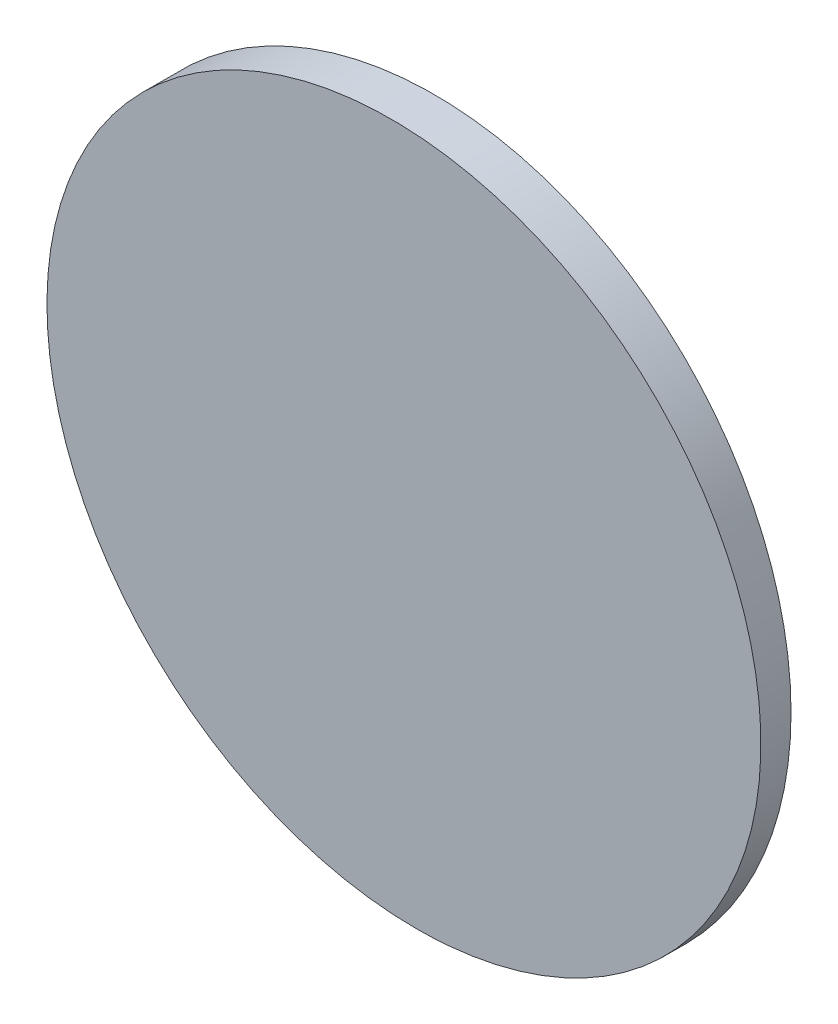
ISO-10303-21;
HEADER;
FILE_DESCRIPTION(('STEP AP214'),'2;1');
FILE_NAME('part.step','',(''),(''),'','','');
FILE_SCHEMA(('AUTOMOTIVE_DESIGN { 1 0 10303 214 1 1 1 1 }'));
ENDSEC;
DATA;
#1=APPLICATION_CONTEXT('core data for automotive mechanical design processes');
#2=APPLICATION_PROTOCOL_DEFINITION('international standard','automotive_design',2000,#1);
#3=PRODUCT_CONTEXT('',#1,'mechanical');
#4=PRODUCT('Part','Part','',(#3));
#5=PRODUCT_RELATED_PRODUCT_CATEGORY('part','',(#4));
#6=PRODUCT_DEFINITION_FORMATION('','',#4);
#7=PRODUCT_DEFINITION_CONTEXT('part definition',#1,'design');
#8=PRODUCT_DEFINITION('design','',#6,#7);
#9=PRODUCT_DEFINITION_SHAPE('','',#8);
#10=(LENGTH_UNIT() NAMED_UNIT(*) SI_UNIT(.MILLI.,.METRE.));
#11=(NAMED_UNIT(*) PLANE_ANGLE_UNIT() SI_UNIT($,.RADIAN.));
#12=(NAMED_UNIT(*) SI_UNIT($,.STERADIAN.) SOLID_ANGLE_UNIT());
#13=UNCERTAINTY_MEASURE_WITH_UNIT(LENGTH_MEASURE(1.E-05),#10,'distance_accuracy_value','');
#14=(GEOMETRIC_REPRESENTATION_CONTEXT(3) GLOBAL_UNCERTAINTY_ASSIGNED_CONTEXT((#13)) GLOBAL_UNIT_ASSIGNED_CONTEXT((#10,
#11,#12)) REPRESENTATION_CONTEXT('',''));
#15=CARTESIAN_POINT('',(0.,0.,0.));
#16=DIRECTION('',(0.,0.,1.));
#17=DIRECTION('',(1.,0.,0.));
#18=AXIS2_PLACEMENT_3D('',#15,#16,#17);
#19=CARTESIAN_POINT('',(0.,0.,6.));
#20=DIRECTION('',(0.,0.,-1.));
#21=DIRECTION('',(-1.,0.,0.));
#22=AXIS2_PLACEMENT_3D('',#19,#20,#21);
#23=CYLINDRICAL_SURFACE('',#22,50.);
#24=CARTESIAN_POINT('',(0.,0.,0.));
#25=DIRECTION('',(0.,0.,1.));
#26=DIRECTION('',(1.,0.,0.));
#27=AXIS2_PLACEMENT_3D('',#24,#25,#26);
#28=CIRCLE('',#27,50.);
#29=CARTESIAN_POINT('',(50.,0.,0.));
#30=VERTEX_POINT('',#29);
#31=EDGE_CURVE('E12',#30,#30,#28,.T.);
#32=ORIENTED_EDGE('',*,*,#31,.T.);
#33=EDGE_LOOP('',(#32));
#34=FACE_BOUND('',#33,.T.);
#35=CARTESIAN_POINT('',(0.,0.,4.25396152541296));
#36=DIRECTION('',(0.,0.034899496702494,-0.999390827019096));
#37=DIRECTION('',(0.,-0.999390827019096,-0.034899496702494));
#38=AXIS2_PLACEMENT_3D('',#35,#36,#37);
#39=ELLIPSE('',#38,50.0304772149411,50.);
#40=CARTESIAN_POINT('',(0.,-50.,2.50792305082592));
#41=VERTEX_POINT('',#40);
#42=EDGE_CURVE('E51',#41,#41,#39,.T.);
#43=ORIENTED_EDGE('',*,*,#42,.T.);
#44=EDGE_LOOP('',(#43));
#45=FACE_BOUND('',#44,.T.);
#46=ADVANCED_FACE('F45',(#34,#45),#23,.T.);
#47=CARTESIAN_POINT('',(0.,0.,0.));
#48=DIRECTION('',(0.,0.,1.));
#49=DIRECTION('',(1.,0.,0.));
#50=AXIS2_PLACEMENT_3D('',#47,#48,#49);
#51=PLANE('',#50);
#52=ORIENTED_EDGE('',*,*,#31,.F.);
#53=EDGE_LOOP('',(#52));
#54=FACE_BOUND('',#53,.T.);
#55=ADVANCED_FACE('F60',(#54),#51,.F.);
#56=CARTESIAN_POINT('',(-50.,50.,6.));
#57=DIRECTION('',(0.,0.034899496702494,-0.999390827019096));
#58=DIRECTION('',(0.,0.999390827019096,0.034899496702494));
#59=AXIS2_PLACEMENT_3D('',#56,#57,#58);
#60=PLANE('',#59);
#61=ORIENTED_EDGE('',*,*,#42,.F.);
#62=EDGE_LOOP('',(#61));
#63=FACE_BOUND('',#62,.T.);
#64=ADVANCED_FACE('F58',(#63),#60,.F.);
#65=CLOSED_SHELL('',(#46,#55,#64));
#66=MANIFOLD_SOLID_BREP('B2',#65);
#67=ADVANCED_BREP_SHAPE_REPRESENTATION('',(#18,#66),#14);
#68=SHAPE_DEFINITION_REPRESENTATION(#9,#67);
ENDSEC;
END-ISO-10303-21;
